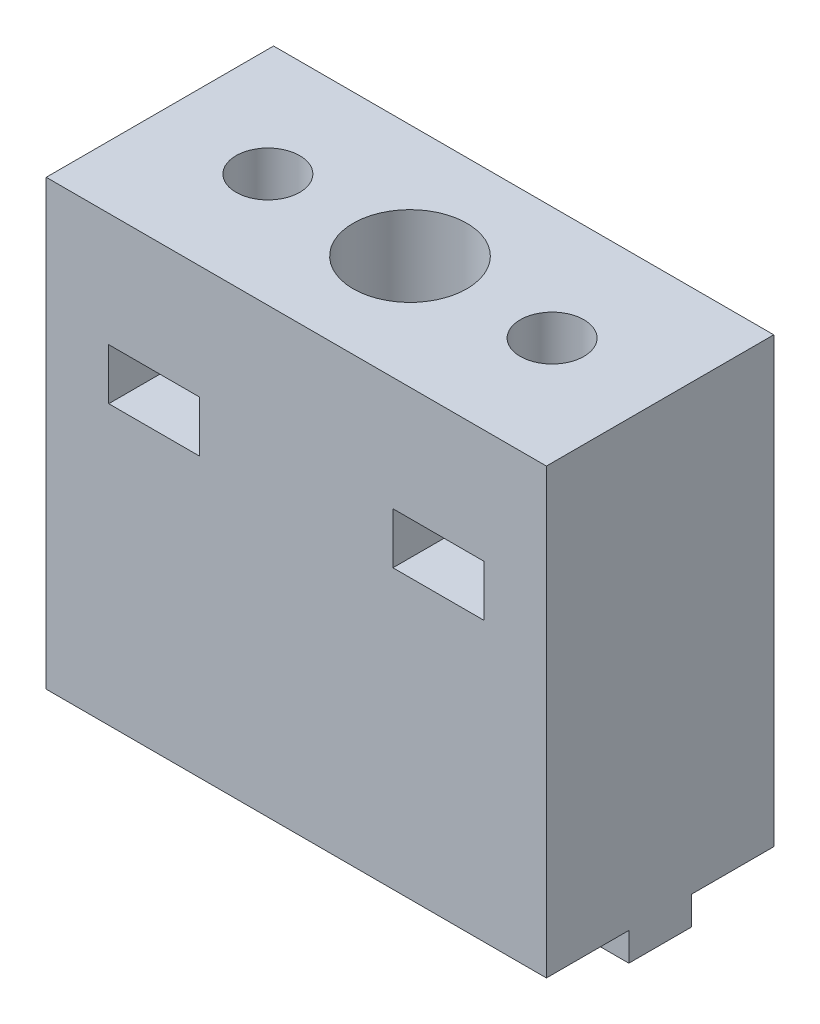
ISO-10303-21;
HEADER;
FILE_DESCRIPTION(('STEP AP214'),'2;1');
FILE_NAME('part.step','',(''),(''),'','','');
FILE_SCHEMA(('AUTOMOTIVE_DESIGN { 1 0 10303 214 1 1 1 1 }'));
ENDSEC;
DATA;
#1=APPLICATION_CONTEXT('core data for automotive mechanical design processes');
#2=APPLICATION_PROTOCOL_DEFINITION('international standard','automotive_design',2000,#1);
#3=PRODUCT_CONTEXT('',#1,'mechanical');
#4=PRODUCT('Part','Part','',(#3));
#5=PRODUCT_RELATED_PRODUCT_CATEGORY('part','',(#4));
#6=PRODUCT_DEFINITION_FORMATION('','',#4);
#7=PRODUCT_DEFINITION_CONTEXT('part definition',#1,'design');
#8=PRODUCT_DEFINITION('design','',#6,#7);
#9=PRODUCT_DEFINITION_SHAPE('','',#8);
#10=(LENGTH_UNIT() NAMED_UNIT(*) SI_UNIT(.MILLI.,.METRE.));
#11=(NAMED_UNIT(*) PLANE_ANGLE_UNIT() SI_UNIT($,.RADIAN.));
#12=(NAMED_UNIT(*) SI_UNIT($,.STERADIAN.) SOLID_ANGLE_UNIT());
#13=UNCERTAINTY_MEASURE_WITH_UNIT(LENGTH_MEASURE(1.E-05),#10,'distance_accuracy_value','');
#14=(GEOMETRIC_REPRESENTATION_CONTEXT(3) GLOBAL_UNCERTAINTY_ASSIGNED_CONTEXT((#13)) GLOBAL_UNIT_ASSIGNED_CONTEXT((#10,
#11,#12)) REPRESENTATION_CONTEXT('',''));
#15=CARTESIAN_POINT('',(0.,0.,0.));
#16=DIRECTION('',(0.,0.,1.));
#17=DIRECTION('',(1.,0.,0.));
#18=AXIS2_PLACEMENT_3D('',#15,#16,#17);
#19=CARTESIAN_POINT('',(21.3032417795605,-2.5,-10.));
#20=DIRECTION('',(0.,1.,0.));
#21=DIRECTION('',(0.,0.,1.));
#22=AXIS2_PLACEMENT_3D('',#19,#20,#21);
#23=CYLINDRICAL_SURFACE('',#22,2.8);
#24=CARTESIAN_POINT('',(21.3032417795605,5.,-10.));
#25=DIRECTION('',(0.,-1.,0.));
#26=DIRECTION('',(0.,0.,-1.));
#27=AXIS2_PLACEMENT_3D('',#24,#25,#26);
#28=CIRCLE('',#27,2.8);
#29=CARTESIAN_POINT('',(21.3032417795605,5.,-12.8));
#30=VERTEX_POINT('',#29);
#31=EDGE_CURVE('E309',#30,#30,#28,.F.);
#32=ORIENTED_EDGE('',*,*,#31,.T.);
#33=EDGE_LOOP('',(#32));
#34=FACE_BOUND('',#33,.T.);
#35=CARTESIAN_POINT('',(21.3032417795605,0.,-10.));
#36=DIRECTION('',(0.,-1.,0.));
#37=DIRECTION('',(0.,0.,-1.));
#38=AXIS2_PLACEMENT_3D('',#35,#36,#37);
#39=CIRCLE('',#38,2.8);
#40=CARTESIAN_POINT('',(21.3032417795605,0.,-12.8));
#41=VERTEX_POINT('',#40);
#42=EDGE_CURVE('E302',#41,#41,#39,.T.);
#43=ORIENTED_EDGE('',*,*,#42,.T.);
#44=EDGE_LOOP('',(#43));
#45=FACE_BOUND('',#44,.T.);
#46=ADVANCED_FACE('F35',(#34,#45),#23,.F.);
#47=CARTESIAN_POINT('',(8.80324177956045,-2.5,-10.));
#48=DIRECTION('',(0.,1.,0.));
#49=DIRECTION('',(0.,0.,1.));
#50=AXIS2_PLACEMENT_3D('',#47,#48,#49);
#51=CYLINDRICAL_SURFACE('',#50,2.8);
#52=CARTESIAN_POINT('',(8.80324177956045,29.,-10.));
#53=DIRECTION('',(0.,1.,0.));
#54=DIRECTION('',(0.,0.,1.));
#55=AXIS2_PLACEMENT_3D('',#52,#53,#54);
#56=CIRCLE('',#55,2.8);
#57=CARTESIAN_POINT('',(8.80324177956045,29.,-7.2));
#58=VERTEX_POINT('',#57);
#59=EDGE_CURVE('E39',#58,#58,#56,.F.);
#60=ORIENTED_EDGE('',*,*,#59,.T.);
#61=EDGE_LOOP('',(#60));
#62=FACE_BOUND('',#61,.T.);
#63=CARTESIAN_POINT('',(8.80324177956045,39.,-10.));
#64=DIRECTION('',(0.,1.,0.));
#65=DIRECTION('',(0.,0.,1.));
#66=AXIS2_PLACEMENT_3D('',#63,#64,#65);
#67=CIRCLE('',#66,2.8);
#68=CARTESIAN_POINT('',(8.80324177956045,39.,-7.2));
#69=VERTEX_POINT('',#68);
#70=EDGE_CURVE('E287',#69,#69,#67,.T.);
#71=ORIENTED_EDGE('',*,*,#70,.T.);
#72=EDGE_LOOP('',(#71));
#73=FACE_BOUND('',#72,.T.);
#74=ADVANCED_FACE('F494',(#62,#73),#51,.F.);
#75=CARTESIAN_POINT('',(33.8032417795605,-2.5,-10.));
#76=DIRECTION('',(0.,1.,0.));
#77=DIRECTION('',(0.,0.,1.));
#78=AXIS2_PLACEMENT_3D('',#75,#76,#77);
#79=CYLINDRICAL_SURFACE('',#78,2.8);
#80=CARTESIAN_POINT('',(33.8032417795605,29.,-10.));
#81=DIRECTION('',(0.,1.,0.));
#82=DIRECTION('',(0.,0.,1.));
#83=AXIS2_PLACEMENT_3D('',#80,#81,#82);
#84=CIRCLE('',#83,2.8);
#85=CARTESIAN_POINT('',(33.8032417795605,29.,-7.2));
#86=VERTEX_POINT('',#85);
#87=EDGE_CURVE('E318',#86,#86,#84,.F.);
#88=ORIENTED_EDGE('',*,*,#87,.T.);
#89=EDGE_LOOP('',(#88));
#90=FACE_BOUND('',#89,.T.);
#91=CARTESIAN_POINT('',(33.8032417795605,39.,-10.));
#92=DIRECTION('',(0.,1.,0.));
#93=DIRECTION('',(0.,0.,1.));
#94=AXIS2_PLACEMENT_3D('',#91,#92,#93);
#95=CIRCLE('',#94,2.8);
#96=CARTESIAN_POINT('',(33.8032417795605,39.,-7.2));
#97=VERTEX_POINT('',#96);
#98=EDGE_CURVE('E306',#97,#97,#95,.T.);
#99=ORIENTED_EDGE('',*,*,#98,.T.);
#100=EDGE_LOOP('',(#99));
#101=FACE_BOUND('',#100,.T.);
#102=ADVANCED_FACE('F521',(#90,#101),#79,.F.);
#103=CARTESIAN_POINT('',(43.3032417795605,-2.5,-12.75));
#104=DIRECTION('',(0.,0.,1.));
#105=DIRECTION('',(1.,0.,0.));
#106=AXIS2_PLACEMENT_3D('',#103,#104,#105);
#107=PLANE('',#106);
#108=DIRECTION('',(1.,0.,0.));
#109=VECTOR('',#108,1.);
#110=CARTESIAN_POINT('',(43.3032417795605,-2.5,-12.75));
#111=LINE('',#110,#109);
#112=CARTESIAN_POINT('',(34.3300244672031,-2.5,-12.75));
#113=VERTEX_POINT('',#112);
#114=CARTESIAN_POINT('',(43.3032417795605,-2.5,-12.75));
#115=VERTEX_POINT('',#114);
#116=EDGE_CURVE('E575',#113,#115,#111,.T.);
#117=ORIENTED_EDGE('',*,*,#116,.F.);
#118=DIRECTION('',(0.,1.,0.));
#119=VECTOR('',#118,1.);
#120=CARTESIAN_POINT('',(34.3300244672031,-2.5,-12.75));
#121=LINE('',#120,#119);
#122=CARTESIAN_POINT('',(34.3300244672031,0.,-12.75));
#123=VERTEX_POINT('',#122);
#124=EDGE_CURVE('E290',#113,#123,#121,.T.);
#125=ORIENTED_EDGE('',*,*,#124,.T.);
#126=DIRECTION('',(1.,0.,0.));
#127=VECTOR('',#126,1.);
#128=CARTESIAN_POINT('',(43.3032417795605,0.,-12.75));
#129=LINE('',#128,#127);
#130=CARTESIAN_POINT('',(43.3032417795605,0.,-12.75));
#131=VERTEX_POINT('',#130);
#132=EDGE_CURVE('E412',#123,#131,#129,.T.);
#133=ORIENTED_EDGE('',*,*,#132,.T.);
#134=DIRECTION('',(0.,1.,0.));
#135=VECTOR('',#134,1.);
#136=CARTESIAN_POINT('',(43.3032417795605,-2.5,-12.75));
#137=LINE('',#136,#135);
#138=EDGE_CURVE('E440',#115,#131,#137,.T.);
#139=ORIENTED_EDGE('',*,*,#138,.F.);
#140=EDGE_LOOP('',(#117,#125,#133,#139));
#141=FACE_BOUND('',#140,.T.);
#142=ADVANCED_FACE('F538',(#141),#107,.F.);
#143=CARTESIAN_POINT('',(26.3032417795604,-2.5,-12.75));
#144=VERTEX_POINT('',#143);
#145=CARTESIAN_POINT('',(33.2764590919178,-2.5,-12.75));
#146=VERTEX_POINT('',#145);
#147=EDGE_CURVE('E576',#144,#146,#111,.T.);
#148=ORIENTED_EDGE('',*,*,#147,.F.);
#149=DIRECTION('',(0.,-1.,0.));
#150=VECTOR('',#149,1.);
#151=CARTESIAN_POINT('',(26.3032417795604,11.4127122105133,-12.75));
#152=LINE('',#151,#150);
#153=CARTESIAN_POINT('',(26.3032417795604,0.,-12.75));
#154=VERTEX_POINT('',#153);
#155=EDGE_CURVE('E228',#154,#144,#152,.T.);
#156=ORIENTED_EDGE('',*,*,#155,.F.);
#157=CARTESIAN_POINT('',(33.2764590919178,0.,-12.75));
#158=VERTEX_POINT('',#157);
#159=EDGE_CURVE('E267',#154,#158,#129,.T.);
#160=ORIENTED_EDGE('',*,*,#159,.T.);
#161=DIRECTION('',(0.,1.,0.));
#162=VECTOR('',#161,1.);
#163=CARTESIAN_POINT('',(33.2764590919178,-2.5,-12.75));
#164=LINE('',#163,#162);
#165=EDGE_CURVE('E295',#158,#146,#164,.F.);
#166=ORIENTED_EDGE('',*,*,#165,.T.);
#167=EDGE_LOOP('',(#148,#156,#160,#166));
#168=FACE_BOUND('',#167,.T.);
#169=ADVANCED_FACE('F585',(#168),#107,.F.);
#170=CARTESIAN_POINT('',(0.,-2.5,0.));
#171=DIRECTION('',(0.,-1.,0.));
#172=DIRECTION('',(0.,0.,-1.));
#173=AXIS2_PLACEMENT_3D('',#170,#171,#172);
#174=PLANE('',#173);
#175=CARTESIAN_POINT('',(33.8032417795605,-2.5,-10.));
#176=DIRECTION('',(0.,1.,0.));
#177=DIRECTION('',(0.,0.,1.));
#178=AXIS2_PLACEMENT_3D('',#175,#176,#177);
#179=CIRCLE('',#178,2.8);
#180=CARTESIAN_POINT('',(34.3300244672031,-2.5,-7.25));
#181=VERTEX_POINT('',#180);
#182=EDGE_CURVE('E305',#181,#113,#179,.T.);
#183=ORIENTED_EDGE('',*,*,#182,.T.);
#184=ORIENTED_EDGE('',*,*,#116,.T.);
#185=DIRECTION('',(0.,0.,1.));
#186=VECTOR('',#185,1.);
#187=CARTESIAN_POINT('',(43.3032417795605,-2.5,-12.75));
#188=LINE('',#187,#186);
#189=CARTESIAN_POINT('',(43.3032417795605,-2.5,-7.25));
#190=VERTEX_POINT('',#189);
#191=EDGE_CURVE('E254',#115,#190,#188,.T.);
#192=ORIENTED_EDGE('',*,*,#191,.T.);
#193=DIRECTION('',(-1.,0.,0.));
#194=VECTOR('',#193,1.);
#195=CARTESIAN_POINT('',(43.3032417795605,-2.5,-7.25));
#196=LINE('',#195,#194);
#197=EDGE_CURVE('E246',#190,#181,#196,.T.);
#198=ORIENTED_EDGE('',*,*,#197,.T.);
#199=EDGE_LOOP('',(#183,#184,#192,#198));
#200=FACE_BOUND('',#199,.T.);
#201=ADVANCED_FACE('F533',(#200),#174,.T.);
#202=DIRECTION('',(0.,0.,1.));
#203=VECTOR('',#202,1.);
#204=CARTESIAN_POINT('',(26.3032417795604,-2.5,-7.25));
#205=LINE('',#204,#203);
#206=CARTESIAN_POINT('',(26.3032417795604,-2.5,-7.25));
#207=VERTEX_POINT('',#206);
#208=EDGE_CURVE('E222',#144,#207,#205,.T.);
#209=ORIENTED_EDGE('',*,*,#208,.F.);
#210=ORIENTED_EDGE('',*,*,#147,.T.);
#211=CARTESIAN_POINT('',(33.2764590919178,-2.5,-7.25));
#212=VERTEX_POINT('',#211);
#213=EDGE_CURVE('E245',#146,#212,#179,.T.);
#214=ORIENTED_EDGE('',*,*,#213,.T.);
#215=EDGE_CURVE('E237',#212,#207,#196,.T.);
#216=ORIENTED_EDGE('',*,*,#215,.T.);
#217=EDGE_LOOP('',(#209,#210,#214,#216));
#218=FACE_BOUND('',#217,.T.);
#219=ADVANCED_FACE('F243',(#218),#174,.T.);
#220=CARTESIAN_POINT('',(43.3032417795605,-2.5,-7.25));
#221=DIRECTION('',(0.,0.,-1.));
#222=DIRECTION('',(-1.,0.,0.));
#223=AXIS2_PLACEMENT_3D('',#220,#221,#222);
#224=PLANE('',#223);
#225=DIRECTION('',(-1.,0.,0.));
#226=VECTOR('',#225,1.);
#227=CARTESIAN_POINT('',(43.3032417795605,0.,-7.25));
#228=LINE('',#227,#226);
#229=CARTESIAN_POINT('',(33.2764590919178,0.,-7.25));
#230=VERTEX_POINT('',#229);
#231=CARTESIAN_POINT('',(26.3032417795604,0.,-7.25));
#232=VERTEX_POINT('',#231);
#233=EDGE_CURVE('E239',#230,#232,#228,.T.);
#234=ORIENTED_EDGE('',*,*,#233,.T.);
#235=DIRECTION('',(0.,-1.,0.));
#236=VECTOR('',#235,1.);
#237=CARTESIAN_POINT('',(26.3032417795604,11.4127122105133,-7.25));
#238=LINE('',#237,#236);
#239=EDGE_CURVE('E225',#232,#207,#238,.T.);
#240=ORIENTED_EDGE('',*,*,#239,.T.);
#241=ORIENTED_EDGE('',*,*,#215,.F.);
#242=DIRECTION('',(0.,1.,0.));
#243=VECTOR('',#242,1.);
#244=CARTESIAN_POINT('',(33.2764590919178,-2.5,-7.25));
#245=LINE('',#244,#243);
#246=EDGE_CURVE('E12',#212,#230,#245,.T.);
#247=ORIENTED_EDGE('',*,*,#246,.T.);
#248=EDGE_LOOP('',(#234,#240,#241,#247));
#249=FACE_BOUND('',#248,.T.);
#250=ADVANCED_FACE('F236',(#249),#224,.F.);
#251=CARTESIAN_POINT('',(16.3032417795605,-2.5,-7.25));
#252=VERTEX_POINT('',#251);
#253=CARTESIAN_POINT('',(9.33002446720312,-2.5,-7.25));
#254=VERTEX_POINT('',#253);
#255=EDGE_CURVE('E247',#252,#254,#196,.T.);
#256=ORIENTED_EDGE('',*,*,#255,.F.);
#257=DIRECTION('',(0.,-1.,0.));
#258=VECTOR('',#257,1.);
#259=CARTESIAN_POINT('',(16.3032417795605,11.4127122105133,-7.25));
#260=LINE('',#259,#258);
#261=CARTESIAN_POINT('',(16.3032417795605,0.,-7.25));
#262=VERTEX_POINT('',#261);
#263=EDGE_CURVE('E240',#262,#252,#260,.T.);
#264=ORIENTED_EDGE('',*,*,#263,.F.);
#265=CARTESIAN_POINT('',(9.33002446720312,0.,-7.25));
#266=VERTEX_POINT('',#265);
#267=EDGE_CURVE('E402',#262,#266,#228,.T.);
#268=ORIENTED_EDGE('',*,*,#267,.T.);
#269=DIRECTION('',(0.,1.,0.));
#270=VECTOR('',#269,1.);
#271=CARTESIAN_POINT('',(9.33002446720312,-2.5,-7.25));
#272=LINE('',#271,#270);
#273=EDGE_CURVE('E275',#266,#254,#272,.F.);
#274=ORIENTED_EDGE('',*,*,#273,.T.);
#275=EDGE_LOOP('',(#256,#264,#268,#274));
#276=FACE_BOUND('',#275,.T.);
#277=ADVANCED_FACE('F401',(#276),#224,.F.);
#278=CARTESIAN_POINT('',(8.27645909191779,-2.5,-7.25));
#279=VERTEX_POINT('',#278);
#280=CARTESIAN_POINT('',(-0.696758220439547,-2.5,-7.25000000000001));
#281=VERTEX_POINT('',#280);
#282=EDGE_CURVE('E249',#279,#281,#196,.T.);
#283=ORIENTED_EDGE('',*,*,#282,.F.);
#284=DIRECTION('',(0.,1.,0.));
#285=VECTOR('',#284,1.);
#286=CARTESIAN_POINT('',(8.27645909191779,-2.5,-7.25));
#287=LINE('',#286,#285);
#288=CARTESIAN_POINT('',(8.27645909191779,0.,-7.25));
#289=VERTEX_POINT('',#288);
#290=EDGE_CURVE('E269',#279,#289,#287,.T.);
#291=ORIENTED_EDGE('',*,*,#290,.T.);
#292=CARTESIAN_POINT('',(-0.696758220439547,0.,-7.25000000000001));
#293=VERTEX_POINT('',#292);
#294=EDGE_CURVE('E272',#289,#293,#228,.T.);
#295=ORIENTED_EDGE('',*,*,#294,.T.);
#296=DIRECTION('',(0.,1.,0.));
#297=VECTOR('',#296,1.);
#298=CARTESIAN_POINT('',(-0.696758220439547,-2.5,-7.25000000000001));
#299=LINE('',#298,#297);
#300=EDGE_CURVE('E439',#281,#293,#299,.T.);
#301=ORIENTED_EDGE('',*,*,#300,.F.);
#302=EDGE_LOOP('',(#283,#291,#295,#301));
#303=FACE_BOUND('',#302,.T.);
#304=ADVANCED_FACE('F541',(#303),#224,.F.);
#305=CARTESIAN_POINT('',(9.33002446720307,0.,-12.75));
#306=VERTEX_POINT('',#305);
#307=CARTESIAN_POINT('',(16.3032417795605,0.,-12.75));
#308=VERTEX_POINT('',#307);
#309=EDGE_CURVE('E265',#306,#308,#129,.T.);
#310=ORIENTED_EDGE('',*,*,#309,.T.);
#311=DIRECTION('',(0.,-1.,0.));
#312=VECTOR('',#311,1.);
#313=CARTESIAN_POINT('',(16.3032417795605,11.4127122105133,-12.75));
#314=LINE('',#313,#312);
#315=CARTESIAN_POINT('',(16.3032417795605,-2.5,-12.75));
#316=VERTEX_POINT('',#315);
#317=EDGE_CURVE('E383',#308,#316,#314,.T.);
#318=ORIENTED_EDGE('',*,*,#317,.T.);
#319=CARTESIAN_POINT('',(9.33002446720307,-2.5,-12.75));
#320=VERTEX_POINT('',#319);
#321=EDGE_CURVE('E577',#320,#316,#111,.T.);
#322=ORIENTED_EDGE('',*,*,#321,.F.);
#323=DIRECTION('',(0.,1.,0.));
#324=VECTOR('',#323,1.);
#325=CARTESIAN_POINT('',(9.33002446720307,-2.5,-12.75));
#326=LINE('',#325,#324);
#327=EDGE_CURVE('E278',#320,#306,#326,.T.);
#328=ORIENTED_EDGE('',*,*,#327,.T.);
#329=EDGE_LOOP('',(#310,#318,#322,#328));
#330=FACE_BOUND('',#329,.T.);
#331=ADVANCED_FACE('F422',(#330),#107,.F.);
#332=DIRECTION('',(0.,0.,-1.));
#333=VECTOR('',#332,1.);
#334=CARTESIAN_POINT('',(16.3032417795605,-2.5,-7.25));
#335=LINE('',#334,#333);
#336=EDGE_CURVE('E232',#252,#316,#335,.T.);
#337=ORIENTED_EDGE('',*,*,#336,.F.);
#338=ORIENTED_EDGE('',*,*,#255,.T.);
#339=CARTESIAN_POINT('',(8.80324177956045,-2.5,-10.));
#340=DIRECTION('',(0.,1.,0.));
#341=DIRECTION('',(0.,0.,1.));
#342=AXIS2_PLACEMENT_3D('',#339,#340,#341);
#343=CIRCLE('',#342,2.8);
#344=EDGE_CURVE('E286',#254,#320,#343,.T.);
#345=ORIENTED_EDGE('',*,*,#344,.T.);
#346=ORIENTED_EDGE('',*,*,#321,.T.);
#347=EDGE_LOOP('',(#337,#338,#345,#346));
#348=FACE_BOUND('',#347,.T.);
#349=ADVANCED_FACE('F534',(#348),#174,.T.);
#350=CARTESIAN_POINT('',(-0.696758220439547,39.,0.));
#351=DIRECTION('',(1.,0.,0.));
#352=DIRECTION('',(0.,0.,-1.));
#353=AXIS2_PLACEMENT_3D('',#350,#351,#352);
#354=PLANE('',#353);
#355=DIRECTION('',(0.,0.,1.));
#356=VECTOR('',#355,1.);
#357=CARTESIAN_POINT('',(-0.696758220439547,0.,0.));
#358=LINE('',#357,#356);
#359=CARTESIAN_POINT('',(-0.696758220439547,0.,-20.));
#360=VERTEX_POINT('',#359);
#361=CARTESIAN_POINT('',(-0.696758220439547,0.,-12.75));
#362=VERTEX_POINT('',#361);
#363=EDGE_CURVE('E460',#360,#362,#358,.T.);
#364=ORIENTED_EDGE('',*,*,#363,.T.);
#365=DIRECTION('',(0.,1.,0.));
#366=VECTOR('',#365,1.);
#367=CARTESIAN_POINT('',(-0.696758220439547,-2.5,-12.75));
#368=LINE('',#367,#366);
#369=CARTESIAN_POINT('',(-0.696758220439547,-2.5,-12.75));
#370=VERTEX_POINT('',#369);
#371=EDGE_CURVE('E435',#370,#362,#368,.T.);
#372=ORIENTED_EDGE('',*,*,#371,.F.);
#373=DIRECTION('',(0.,0.,-1.));
#374=VECTOR('',#373,1.);
#375=CARTESIAN_POINT('',(-0.696758220439547,-2.5,-12.75));
#376=LINE('',#375,#374);
#377=EDGE_CURVE('E251',#281,#370,#376,.T.);
#378=ORIENTED_EDGE('',*,*,#377,.F.);
#379=ORIENTED_EDGE('',*,*,#300,.T.);
#380=CARTESIAN_POINT('',(-0.696758220439547,0.,0.));
#381=VERTEX_POINT('',#380);
#382=EDGE_CURVE('E448',#293,#381,#358,.T.);
#383=ORIENTED_EDGE('',*,*,#382,.T.);
#384=DIRECTION('',(0.,-1.,0.));
#385=VECTOR('',#384,1.);
#386=CARTESIAN_POINT('',(-0.696758220439547,39.,0.));
#387=LINE('',#386,#385);
#388=CARTESIAN_POINT('',(-0.696758220439547,39.,0.));
#389=VERTEX_POINT('',#388);
#390=EDGE_CURVE('E477',#389,#381,#387,.T.);
#391=ORIENTED_EDGE('',*,*,#390,.F.);
#392=DIRECTION('',(0.,0.,1.));
#393=VECTOR('',#392,1.);
#394=CARTESIAN_POINT('',(-0.696758220439547,39.,0.));
#395=LINE('',#394,#393);
#396=CARTESIAN_POINT('',(-0.696758220439547,39.,-20.));
#397=VERTEX_POINT('',#396);
#398=EDGE_CURVE('E449',#397,#389,#395,.T.);
#399=ORIENTED_EDGE('',*,*,#398,.F.);
#400=DIRECTION('',(0.,-1.,0.));
#401=VECTOR('',#400,1.);
#402=CARTESIAN_POINT('',(-0.696758220439547,39.,-20.));
#403=LINE('',#402,#401);
#404=EDGE_CURVE('E459',#397,#360,#403,.T.);
#405=ORIENTED_EDGE('',*,*,#404,.T.);
#406=EDGE_LOOP('',(#364,#372,#378,#379,#383,#391,#399,#405));
#407=FACE_BOUND('',#406,.T.);
#408=ADVANCED_FACE('F37',(#407),#354,.F.);
#409=CARTESIAN_POINT('',(-0.696758220439547,39.,0.));
#410=DIRECTION('',(0.,0.,-1.));
#411=DIRECTION('',(-1.,0.,0.));
#412=AXIS2_PLACEMENT_3D('',#409,#410,#411);
#413=PLANE('',#412);
#414=DIRECTION('',(1.,0.,0.));
#415=VECTOR('',#414,1.);
#416=CARTESIAN_POINT('',(12.8032417795605,29.,0.));
#417=LINE('',#416,#415);
#418=CARTESIAN_POINT('',(4.80324177956045,29.,0.));
#419=VERTEX_POINT('',#418);
#420=CARTESIAN_POINT('',(12.8032417795605,29.,0.));
#421=VERTEX_POINT('',#420);
#422=EDGE_CURVE('E355',#419,#421,#417,.T.);
#423=ORIENTED_EDGE('',*,*,#422,.T.);
#424=DIRECTION('',(0.,-1.,0.));
#425=VECTOR('',#424,1.);
#426=CARTESIAN_POINT('',(12.8032417795605,24.5,0.));
#427=LINE('',#426,#425);
#428=CARTESIAN_POINT('',(12.8032417795605,24.5,0.));
#429=VERTEX_POINT('',#428);
#430=EDGE_CURVE('E365',#421,#429,#427,.T.);
#431=ORIENTED_EDGE('',*,*,#430,.T.);
#432=DIRECTION('',(-1.,0.,0.));
#433=VECTOR('',#432,1.);
#434=CARTESIAN_POINT('',(12.8032417795605,24.5,0.));
#435=LINE('',#434,#433);
#436=CARTESIAN_POINT('',(4.80324177956045,24.5,0.));
#437=VERTEX_POINT('',#436);
#438=EDGE_CURVE('E377',#429,#437,#435,.T.);
#439=ORIENTED_EDGE('',*,*,#438,.T.);
#440=DIRECTION('',(0.,1.,0.));
#441=VECTOR('',#440,1.);
#442=CARTESIAN_POINT('',(4.80324177956045,24.5,0.));
#443=LINE('',#442,#441);
#444=EDGE_CURVE('E52',#437,#419,#443,.T.);
#445=ORIENTED_EDGE('',*,*,#444,.T.);
#446=EDGE_LOOP('',(#423,#431,#439,#445));
#447=FACE_BOUND('',#446,.T.);
#448=DIRECTION('',(1.,0.,0.));
#449=VECTOR('',#448,1.);
#450=CARTESIAN_POINT('',(37.8032417795605,29.,0.));
#451=LINE('',#450,#449);
#452=CARTESIAN_POINT('',(29.8032417795605,29.,0.));
#453=VERTEX_POINT('',#452);
#454=CARTESIAN_POINT('',(37.8032417795605,29.,0.));
#455=VERTEX_POINT('',#454);
#456=EDGE_CURVE('E323',#453,#455,#451,.T.);
#457=ORIENTED_EDGE('',*,*,#456,.T.);
#458=DIRECTION('',(0.,-1.,0.));
#459=VECTOR('',#458,1.);
#460=CARTESIAN_POINT('',(37.8032417795605,24.5,0.));
#461=LINE('',#460,#459);
#462=CARTESIAN_POINT('',(37.8032417795605,24.5,0.));
#463=VERTEX_POINT('',#462);
#464=EDGE_CURVE('E333',#455,#463,#461,.T.);
#465=ORIENTED_EDGE('',*,*,#464,.T.);
#466=DIRECTION('',(-1.,0.,0.));
#467=VECTOR('',#466,1.);
#468=CARTESIAN_POINT('',(37.8032417795605,24.5,0.));
#469=LINE('',#468,#467);
#470=CARTESIAN_POINT('',(29.8032417795605,24.5,0.));
#471=VERTEX_POINT('',#470);
#472=EDGE_CURVE('E347',#463,#471,#469,.T.);
#473=ORIENTED_EDGE('',*,*,#472,.T.);
#474=DIRECTION('',(0.,1.,0.));
#475=VECTOR('',#474,1.);
#476=CARTESIAN_POINT('',(29.8032417795605,24.5,0.));
#477=LINE('',#476,#475);
#478=EDGE_CURVE('E344',#471,#453,#477,.T.);
#479=ORIENTED_EDGE('',*,*,#478,.T.);
#480=EDGE_LOOP('',(#457,#465,#473,#479));
#481=FACE_BOUND('',#480,.T.);
#482=DIRECTION('',(1.,0.,0.));
#483=VECTOR('',#482,1.);
#484=CARTESIAN_POINT('',(-0.696758220439547,0.,0.));
#485=LINE('',#484,#483);
#486=CARTESIAN_POINT('',(43.3032417795605,0.,0.));
#487=VERTEX_POINT('',#486);
#488=EDGE_CURVE('E462',#381,#487,#485,.T.);
#489=ORIENTED_EDGE('',*,*,#488,.T.);
#490=DIRECTION('',(0.,-1.,0.));
#491=VECTOR('',#490,1.);
#492=CARTESIAN_POINT('',(43.3032417795605,39.,0.));
#493=LINE('',#492,#491);
#494=CARTESIAN_POINT('',(43.3032417795605,39.,0.));
#495=VERTEX_POINT('',#494);
#496=EDGE_CURVE('E474',#495,#487,#493,.T.);
#497=ORIENTED_EDGE('',*,*,#496,.F.);
#498=DIRECTION('',(1.,0.,0.));
#499=VECTOR('',#498,1.);
#500=CARTESIAN_POINT('',(-0.696758220439547,39.,0.));
#501=LINE('',#500,#499);
#502=EDGE_CURVE('E452',#389,#495,#501,.T.);
#503=ORIENTED_EDGE('',*,*,#502,.F.);
#504=ORIENTED_EDGE('',*,*,#390,.T.);
#505=EDGE_LOOP('',(#489,#497,#503,#504));
#506=FACE_BOUND('',#505,.T.);
#507=ADVANCED_FACE('F554',(#447,#481,#506),#413,.F.);
#508=CARTESIAN_POINT('',(43.3032417795605,39.,0.));
#509=DIRECTION('',(-1.,0.,0.));
#510=DIRECTION('',(0.,0.,1.));
#511=AXIS2_PLACEMENT_3D('',#508,#509,#510);
#512=PLANE('',#511);
#513=DIRECTION('',(0.,0.,-1.));
#514=VECTOR('',#513,1.);
#515=CARTESIAN_POINT('',(43.3032417795605,0.,0.));
#516=LINE('',#515,#514);
#517=CARTESIAN_POINT('',(43.3032417795605,0.,-7.25));
#518=VERTEX_POINT('',#517);
#519=EDGE_CURVE('E465',#487,#518,#516,.T.);
#520=ORIENTED_EDGE('',*,*,#519,.T.);
#521=DIRECTION('',(0.,1.,0.));
#522=VECTOR('',#521,1.);
#523=CARTESIAN_POINT('',(43.3032417795605,-2.5,-7.25));
#524=LINE('',#523,#522);
#525=EDGE_CURVE('E443',#190,#518,#524,.T.);
#526=ORIENTED_EDGE('',*,*,#525,.F.);
#527=ORIENTED_EDGE('',*,*,#191,.F.);
#528=ORIENTED_EDGE('',*,*,#138,.T.);
#529=CARTESIAN_POINT('',(43.3032417795605,0.,-20.));
#530=VERTEX_POINT('',#529);
#531=EDGE_CURVE('E464',#131,#530,#516,.T.);
#532=ORIENTED_EDGE('',*,*,#531,.T.);
#533=DIRECTION('',(0.,-1.,0.));
#534=VECTOR('',#533,1.);
#535=CARTESIAN_POINT('',(43.3032417795605,39.,-20.));
#536=LINE('',#535,#534);
#537=CARTESIAN_POINT('',(43.3032417795605,39.,-20.));
#538=VERTEX_POINT('',#537);
#539=EDGE_CURVE('E471',#538,#530,#536,.T.);
#540=ORIENTED_EDGE('',*,*,#539,.F.);
#541=DIRECTION('',(0.,0.,-1.));
#542=VECTOR('',#541,1.);
#543=CARTESIAN_POINT('',(43.3032417795605,39.,0.));
#544=LINE('',#543,#542);
#545=EDGE_CURVE('E455',#495,#538,#544,.T.);
#546=ORIENTED_EDGE('',*,*,#545,.F.);
#547=ORIENTED_EDGE('',*,*,#496,.T.);
#548=EDGE_LOOP('',(#520,#526,#527,#528,#532,#540,#546,#547));
#549=FACE_BOUND('',#548,.T.);
#550=ADVANCED_FACE('F551',(#549),#512,.F.);
#551=CARTESIAN_POINT('',(-0.696758220439547,39.,-20.));
#552=DIRECTION('',(0.,0.,1.));
#553=DIRECTION('',(1.,0.,0.));
#554=AXIS2_PLACEMENT_3D('',#551,#552,#553);
#555=PLANE('',#554);
#556=DIRECTION('',(-1.,0.,0.));
#557=VECTOR('',#556,1.);
#558=CARTESIAN_POINT('',(12.8032417795605,24.5,-20.));
#559=LINE('',#558,#557);
#560=CARTESIAN_POINT('',(12.8032417795605,24.5,-20.));
#561=VERTEX_POINT('',#560);
#562=CARTESIAN_POINT('',(4.80324177956045,24.5,-20.));
#563=VERTEX_POINT('',#562);
#564=EDGE_CURVE('E369',#561,#563,#559,.T.);
#565=ORIENTED_EDGE('',*,*,#564,.F.);
#566=DIRECTION('',(0.,-1.,0.));
#567=VECTOR('',#566,1.);
#568=CARTESIAN_POINT('',(12.8032417795605,24.5,-20.));
#569=LINE('',#568,#567);
#570=CARTESIAN_POINT('',(12.8032417795605,29.,-20.));
#571=VERTEX_POINT('',#570);
#572=EDGE_CURVE('E60',#571,#561,#569,.T.);
#573=ORIENTED_EDGE('',*,*,#572,.F.);
#574=DIRECTION('',(1.,0.,0.));
#575=VECTOR('',#574,1.);
#576=CARTESIAN_POINT('',(12.8032417795605,29.,-20.));
#577=LINE('',#576,#575);
#578=CARTESIAN_POINT('',(4.80324177956045,29.,-20.));
#579=VERTEX_POINT('',#578);
#580=EDGE_CURVE('E362',#579,#571,#577,.T.);
#581=ORIENTED_EDGE('',*,*,#580,.F.);
#582=DIRECTION('',(0.,1.,0.));
#583=VECTOR('',#582,1.);
#584=CARTESIAN_POINT('',(4.80324177956045,24.5,-20.));
#585=LINE('',#584,#583);
#586=EDGE_CURVE('E366',#563,#579,#585,.T.);
#587=ORIENTED_EDGE('',*,*,#586,.F.);
#588=EDGE_LOOP('',(#565,#573,#581,#587));
#589=FACE_BOUND('',#588,.T.);
#590=DIRECTION('',(-1.,0.,0.));
#591=VECTOR('',#590,1.);
#592=CARTESIAN_POINT('',(37.8032417795605,24.5,-20.));
#593=LINE('',#592,#591);
#594=CARTESIAN_POINT('',(37.8032417795605,24.5,-20.));
#595=VERTEX_POINT('',#594);
#596=CARTESIAN_POINT('',(29.8032417795605,24.5,-20.));
#597=VERTEX_POINT('',#596);
#598=EDGE_CURVE('E337',#595,#597,#593,.T.);
#599=ORIENTED_EDGE('',*,*,#598,.F.);
#600=DIRECTION('',(0.,-1.,0.));
#601=VECTOR('',#600,1.);
#602=CARTESIAN_POINT('',(37.8032417795605,24.5,-20.));
#603=LINE('',#602,#601);
#604=CARTESIAN_POINT('',(37.8032417795605,29.,-20.));
#605=VERTEX_POINT('',#604);
#606=EDGE_CURVE('E340',#605,#595,#603,.T.);
#607=ORIENTED_EDGE('',*,*,#606,.F.);
#608=DIRECTION('',(1.,0.,0.));
#609=VECTOR('',#608,1.);
#610=CARTESIAN_POINT('',(37.8032417795605,29.,-20.));
#611=LINE('',#610,#609);
#612=CARTESIAN_POINT('',(29.8032417795605,29.,-20.));
#613=VERTEX_POINT('',#612);
#614=EDGE_CURVE('E330',#613,#605,#611,.T.);
#615=ORIENTED_EDGE('',*,*,#614,.F.);
#616=DIRECTION('',(0.,1.,0.));
#617=VECTOR('',#616,1.);
#618=CARTESIAN_POINT('',(29.8032417795605,24.5,-20.));
#619=LINE('',#618,#617);
#620=EDGE_CURVE('E334',#597,#613,#619,.T.);
#621=ORIENTED_EDGE('',*,*,#620,.F.);
#622=EDGE_LOOP('',(#599,#607,#615,#621));
#623=FACE_BOUND('',#622,.T.);
#624=DIRECTION('',(-1.,0.,0.));
#625=VECTOR('',#624,1.);
#626=CARTESIAN_POINT('',(-0.696758220439547,0.,-20.));
#627=LINE('',#626,#625);
#628=EDGE_CURVE('E453',#530,#360,#627,.T.);
#629=ORIENTED_EDGE('',*,*,#628,.T.);
#630=ORIENTED_EDGE('',*,*,#404,.F.);
#631=DIRECTION('',(-1.,0.,0.));
#632=VECTOR('',#631,1.);
#633=CARTESIAN_POINT('',(-0.696758220439547,39.,-20.));
#634=LINE('',#633,#632);
#635=EDGE_CURVE('E457',#538,#397,#634,.T.);
#636=ORIENTED_EDGE('',*,*,#635,.F.);
#637=ORIENTED_EDGE('',*,*,#539,.T.);
#638=EDGE_LOOP('',(#629,#630,#636,#637));
#639=FACE_BOUND('',#638,.T.);
#640=ADVANCED_FACE('F545',(#589,#623,#639),#555,.F.);
#641=CARTESIAN_POINT('',(0.,39.,0.));
#642=DIRECTION('',(0.,-1.,0.));
#643=DIRECTION('',(0.,0.,-1.));
#644=AXIS2_PLACEMENT_3D('',#641,#642,#643);
#645=PLANE('',#644);
#646=CARTESIAN_POINT('',(21.3032417795605,39.,-10.));
#647=DIRECTION('',(0.,1.,0.));
#648=DIRECTION('',(0.,0.,1.));
#649=AXIS2_PLACEMENT_3D('',#646,#647,#648);
#650=CIRCLE('',#649,5.);
#651=CARTESIAN_POINT('',(21.3032417795605,39.,-5.));
#652=VERTEX_POINT('',#651);
#653=EDGE_CURVE('E315',#652,#652,#650,.T.);
#654=ORIENTED_EDGE('',*,*,#653,.F.);
#655=EDGE_LOOP('',(#654));
#656=FACE_BOUND('',#655,.T.);
#657=ORIENTED_EDGE('',*,*,#98,.F.);
#658=EDGE_LOOP('',(#657));
#659=FACE_BOUND('',#658,.T.);
#660=ORIENTED_EDGE('',*,*,#70,.F.);
#661=EDGE_LOOP('',(#660));
#662=FACE_BOUND('',#661,.T.);
#663=ORIENTED_EDGE('',*,*,#398,.T.);
#664=ORIENTED_EDGE('',*,*,#502,.T.);
#665=ORIENTED_EDGE('',*,*,#545,.T.);
#666=ORIENTED_EDGE('',*,*,#635,.T.);
#667=EDGE_LOOP('',(#663,#664,#665,#666));
#668=FACE_BOUND('',#667,.T.);
#669=ADVANCED_FACE('F542',(#656,#659,#662,#668),#645,.F.);
#670=CARTESIAN_POINT('',(0.,0.,0.));
#671=DIRECTION('',(0.,-1.,0.));
#672=DIRECTION('',(0.,0.,-1.));
#673=AXIS2_PLACEMENT_3D('',#670,#671,#672);
#674=PLANE('',#673);
#675=DIRECTION('',(0.,0.,1.));
#676=VECTOR('',#675,1.);
#677=CARTESIAN_POINT('',(16.3032417795605,0.,-7.25));
#678=LINE('',#677,#676);
#679=EDGE_CURVE('E387',#308,#262,#678,.T.);
#680=ORIENTED_EDGE('',*,*,#679,.F.);
#681=ORIENTED_EDGE('',*,*,#309,.F.);
#682=CARTESIAN_POINT('',(8.80324177956045,0.,-10.));
#683=DIRECTION('',(0.,-1.,0.));
#684=DIRECTION('',(0.,0.,-1.));
#685=AXIS2_PLACEMENT_3D('',#682,#683,#684);
#686=CIRCLE('',#685,2.8);
#687=CARTESIAN_POINT('',(8.27645909191783,0.,-12.75));
#688=VERTEX_POINT('',#687);
#689=EDGE_CURVE('E281',#688,#306,#686,.T.);
#690=ORIENTED_EDGE('',*,*,#689,.F.);
#691=EDGE_CURVE('E260',#362,#688,#129,.T.);
#692=ORIENTED_EDGE('',*,*,#691,.F.);
#693=ORIENTED_EDGE('',*,*,#363,.F.);
#694=ORIENTED_EDGE('',*,*,#628,.F.);
#695=ORIENTED_EDGE('',*,*,#531,.F.);
#696=ORIENTED_EDGE('',*,*,#132,.F.);
#697=CARTESIAN_POINT('',(33.8032417795605,0.,-10.));
#698=DIRECTION('',(0.,-1.,0.));
#699=DIRECTION('',(0.,0.,-1.));
#700=AXIS2_PLACEMENT_3D('',#697,#698,#699);
#701=CIRCLE('',#700,2.8);
#702=EDGE_CURVE('E298',#158,#123,#701,.T.);
#703=ORIENTED_EDGE('',*,*,#702,.F.);
#704=ORIENTED_EDGE('',*,*,#159,.F.);
#705=DIRECTION('',(0.,0.,-1.));
#706=VECTOR('',#705,1.);
#707=CARTESIAN_POINT('',(26.3032417795604,0.,-7.25));
#708=LINE('',#707,#706);
#709=EDGE_CURVE('E373',#232,#154,#708,.T.);
#710=ORIENTED_EDGE('',*,*,#709,.F.);
#711=ORIENTED_EDGE('',*,*,#233,.F.);
#712=CARTESIAN_POINT('',(33.8032417795605,0.,-10.));
#713=DIRECTION('',(0.,-1.,0.));
#714=DIRECTION('',(0.,0.,-1.));
#715=AXIS2_PLACEMENT_3D('',#712,#713,#714);
#716=CIRCLE('',#715,2.8);
#717=CARTESIAN_POINT('',(34.3300244672031,0.,-7.25));
#718=VERTEX_POINT('',#717);
#719=EDGE_CURVE('E300',#718,#230,#716,.T.);
#720=ORIENTED_EDGE('',*,*,#719,.F.);
#721=EDGE_CURVE('E409',#518,#718,#228,.T.);
#722=ORIENTED_EDGE('',*,*,#721,.F.);
#723=ORIENTED_EDGE('',*,*,#519,.F.);
#724=ORIENTED_EDGE('',*,*,#488,.F.);
#725=ORIENTED_EDGE('',*,*,#382,.F.);
#726=ORIENTED_EDGE('',*,*,#294,.F.);
#727=CARTESIAN_POINT('',(8.80324177956045,0.,-10.));
#728=DIRECTION('',(0.,-1.,0.));
#729=DIRECTION('',(0.,0.,-1.));
#730=AXIS2_PLACEMENT_3D('',#727,#728,#729);
#731=CIRCLE('',#730,2.8);
#732=EDGE_CURVE('E273',#266,#289,#731,.T.);
#733=ORIENTED_EDGE('',*,*,#732,.F.);
#734=ORIENTED_EDGE('',*,*,#267,.F.);
#735=EDGE_LOOP('',(#680,#681,#690,#692,#693,#694,#695,#696,#703,#704,#710,#711,#720,#722,#723,
#724,#725,#726,#733,#734));
#736=FACE_BOUND('',#735,.T.);
#737=ORIENTED_EDGE('',*,*,#42,.F.);
#738=EDGE_LOOP('',(#737));
#739=FACE_BOUND('',#738,.T.);
#740=ADVANCED_FACE('F405',(#736,#739),#674,.T.);
#741=ORIENTED_EDGE('',*,*,#721,.T.);
#742=DIRECTION('',(0.,1.,0.));
#743=VECTOR('',#742,1.);
#744=CARTESIAN_POINT('',(34.3300244672031,-2.5,-7.25));
#745=LINE('',#744,#743);
#746=EDGE_CURVE('E44',#718,#181,#745,.F.);
#747=ORIENTED_EDGE('',*,*,#746,.T.);
#748=ORIENTED_EDGE('',*,*,#197,.F.);
#749=ORIENTED_EDGE('',*,*,#525,.T.);
#750=EDGE_LOOP('',(#741,#747,#748,#749));
#751=FACE_BOUND('',#750,.T.);
#752=ADVANCED_FACE('F537',(#751),#224,.F.);
#753=ORIENTED_EDGE('',*,*,#691,.T.);
#754=DIRECTION('',(0.,1.,0.));
#755=VECTOR('',#754,1.);
#756=CARTESIAN_POINT('',(8.27645909191783,-2.5,-12.75));
#757=LINE('',#756,#755);
#758=CARTESIAN_POINT('',(8.27645909191784,-2.5,-12.75));
#759=VERTEX_POINT('',#758);
#760=EDGE_CURVE('E283',#688,#759,#757,.F.);
#761=ORIENTED_EDGE('',*,*,#760,.T.);
#762=EDGE_CURVE('E436',#370,#759,#111,.T.);
#763=ORIENTED_EDGE('',*,*,#762,.F.);
#764=ORIENTED_EDGE('',*,*,#371,.T.);
#765=EDGE_LOOP('',(#753,#761,#763,#764));
#766=FACE_BOUND('',#765,.T.);
#767=ADVANCED_FACE('F431',(#766),#107,.F.);
#768=CARTESIAN_POINT('',(8.80324177956045,-2.5,-10.));
#769=DIRECTION('',(0.,-1.,0.));
#770=DIRECTION('',(0.,0.,-1.));
#771=AXIS2_PLACEMENT_3D('',#768,#769,#770);
#772=CIRCLE('',#771,2.8);
#773=EDGE_CURVE('E480',#279,#759,#772,.T.);
#774=ORIENTED_EDGE('',*,*,#773,.F.);
#775=ORIENTED_EDGE('',*,*,#282,.T.);
#776=ORIENTED_EDGE('',*,*,#377,.T.);
#777=ORIENTED_EDGE('',*,*,#762,.T.);
#778=EDGE_LOOP('',(#774,#775,#776,#777));
#779=FACE_BOUND('',#778,.T.);
#780=ADVANCED_FACE('F530',(#779),#174,.T.);
#781=CARTESIAN_POINT('',(8.80324177956045,24.5,-10.));
#782=DIRECTION('',(0.,-1.,0.));
#783=DIRECTION('',(0.,0.,-1.));
#784=AXIS2_PLACEMENT_3D('',#781,#782,#783);
#785=CIRCLE('',#784,2.8);
#786=CARTESIAN_POINT('',(8.80324177956045,24.5,-12.8));
#787=VERTEX_POINT('',#786);
#788=EDGE_CURVE('E361',#787,#787,#785,.F.);
#789=ORIENTED_EDGE('',*,*,#788,.T.);
#790=EDGE_LOOP('',(#789));
#791=FACE_BOUND('',#790,.T.);
#792=ORIENTED_EDGE('',*,*,#773,.T.);
#793=ORIENTED_EDGE('',*,*,#760,.F.);
#794=ORIENTED_EDGE('',*,*,#689,.T.);
#795=ORIENTED_EDGE('',*,*,#327,.F.);
#796=ORIENTED_EDGE('',*,*,#344,.F.);
#797=ORIENTED_EDGE('',*,*,#273,.F.);
#798=ORIENTED_EDGE('',*,*,#732,.T.);
#799=ORIENTED_EDGE('',*,*,#290,.F.);
#800=EDGE_LOOP('',(#792,#793,#794,#795,#796,#797,#798,#799));
#801=FACE_BOUND('',#800,.T.);
#802=ADVANCED_FACE('F523',(#791,#801),#51,.F.);
#803=CARTESIAN_POINT('',(33.8032417795605,24.5,-10.));
#804=DIRECTION('',(0.,-1.,0.));
#805=DIRECTION('',(0.,0.,-1.));
#806=AXIS2_PLACEMENT_3D('',#803,#804,#805);
#807=CIRCLE('',#806,2.8);
#808=CARTESIAN_POINT('',(33.8032417795605,24.5,-12.8));
#809=VERTEX_POINT('',#808);
#810=EDGE_CURVE('E329',#809,#809,#807,.F.);
#811=ORIENTED_EDGE('',*,*,#810,.T.);
#812=EDGE_LOOP('',(#811));
#813=FACE_BOUND('',#812,.T.);
#814=ORIENTED_EDGE('',*,*,#182,.F.);
#815=ORIENTED_EDGE('',*,*,#746,.F.);
#816=ORIENTED_EDGE('',*,*,#719,.T.);
#817=ORIENTED_EDGE('',*,*,#246,.F.);
#818=ORIENTED_EDGE('',*,*,#213,.F.);
#819=ORIENTED_EDGE('',*,*,#165,.F.);
#820=ORIENTED_EDGE('',*,*,#702,.T.);
#821=ORIENTED_EDGE('',*,*,#124,.F.);
#822=EDGE_LOOP('',(#814,#815,#816,#817,#818,#819,#820,#821));
#823=FACE_BOUND('',#822,.T.);
#824=ADVANCED_FACE('F526',(#813,#823),#79,.F.);
#825=CARTESIAN_POINT('',(0.,5.,0.));
#826=DIRECTION('',(0.,-1.,0.));
#827=DIRECTION('',(0.,0.,-1.));
#828=AXIS2_PLACEMENT_3D('',#825,#826,#827);
#829=PLANE('',#828);
#830=CARTESIAN_POINT('',(21.3032417795605,5.,-10.));
#831=DIRECTION('',(0.,-1.,0.));
#832=DIRECTION('',(0.,0.,-1.));
#833=AXIS2_PLACEMENT_3D('',#830,#831,#832);
#834=CIRCLE('',#833,5.);
#835=CARTESIAN_POINT('',(21.3032417795605,5.,-15.));
#836=VERTEX_POINT('',#835);
#837=EDGE_CURVE('E312',#836,#836,#834,.F.);
#838=ORIENTED_EDGE('',*,*,#837,.T.);
#839=EDGE_LOOP('',(#838));
#840=FACE_BOUND('',#839,.T.);
#841=ORIENTED_EDGE('',*,*,#31,.F.);
#842=EDGE_LOOP('',(#841));
#843=FACE_BOUND('',#842,.T.);
#844=ADVANCED_FACE('F615',(#840,#843),#829,.F.);
#845=CARTESIAN_POINT('',(21.3032417795605,-14.142135623731,-10.));
#846=DIRECTION('',(0.,1.,0.));
#847=DIRECTION('',(0.,0.,1.));
#848=AXIS2_PLACEMENT_3D('',#845,#846,#847);
#849=CYLINDRICAL_SURFACE('',#848,5.);
#850=ORIENTED_EDGE('',*,*,#653,.T.);
#851=EDGE_LOOP('',(#850));
#852=FACE_BOUND('',#851,.T.);
#853=ORIENTED_EDGE('',*,*,#837,.F.);
#854=EDGE_LOOP('',(#853));
#855=FACE_BOUND('',#854,.T.);
#856=ADVANCED_FACE('F620',(#852,#855),#849,.F.);
#857=CARTESIAN_POINT('',(37.8032417795605,29.,0.));
#858=DIRECTION('',(0.,1.,0.));
#859=DIRECTION('',(0.,0.,1.));
#860=AXIS2_PLACEMENT_3D('',#857,#858,#859);
#861=PLANE('',#860);
#862=ORIENTED_EDGE('',*,*,#614,.T.);
#863=DIRECTION('',(0.,0.,-1.));
#864=VECTOR('',#863,1.);
#865=CARTESIAN_POINT('',(37.8032417795605,29.,0.));
#866=LINE('',#865,#864);
#867=EDGE_CURVE('E327',#455,#605,#866,.T.);
#868=ORIENTED_EDGE('',*,*,#867,.F.);
#869=ORIENTED_EDGE('',*,*,#456,.F.);
#870=DIRECTION('',(0.,0.,-1.));
#871=VECTOR('',#870,1.);
#872=CARTESIAN_POINT('',(29.8032417795605,29.,0.));
#873=LINE('',#872,#871);
#874=EDGE_CURVE('E325',#453,#613,#873,.T.);
#875=ORIENTED_EDGE('',*,*,#874,.T.);
#876=EDGE_LOOP('',(#862,#868,#869,#875));
#877=FACE_BOUND('',#876,.T.);
#878=ORIENTED_EDGE('',*,*,#87,.F.);
#879=EDGE_LOOP('',(#878));
#880=FACE_BOUND('',#879,.T.);
#881=ADVANCED_FACE('F626',(#877,#880),#861,.F.);
#882=CARTESIAN_POINT('',(37.8032417795605,24.5,0.));
#883=DIRECTION('',(0.,-1.,0.));
#884=DIRECTION('',(0.,0.,-1.));
#885=AXIS2_PLACEMENT_3D('',#882,#883,#884);
#886=PLANE('',#885);
#887=ORIENTED_EDGE('',*,*,#598,.T.);
#888=DIRECTION('',(0.,0.,-1.));
#889=VECTOR('',#888,1.);
#890=CARTESIAN_POINT('',(29.8032417795605,24.5,0.));
#891=LINE('',#890,#889);
#892=EDGE_CURVE('E322',#471,#597,#891,.T.);
#893=ORIENTED_EDGE('',*,*,#892,.F.);
#894=ORIENTED_EDGE('',*,*,#472,.F.);
#895=DIRECTION('',(0.,0.,-1.));
#896=VECTOR('',#895,1.);
#897=CARTESIAN_POINT('',(37.8032417795605,24.5,0.));
#898=LINE('',#897,#896);
#899=EDGE_CURVE('E319',#463,#595,#898,.T.);
#900=ORIENTED_EDGE('',*,*,#899,.T.);
#901=EDGE_LOOP('',(#887,#893,#894,#900));
#902=FACE_BOUND('',#901,.T.);
#903=ORIENTED_EDGE('',*,*,#810,.F.);
#904=EDGE_LOOP('',(#903));
#905=FACE_BOUND('',#904,.T.);
#906=ADVANCED_FACE('F624',(#902,#905),#886,.F.);
#907=CARTESIAN_POINT('',(37.8032417795605,24.5,0.));
#908=DIRECTION('',(1.,0.,0.));
#909=DIRECTION('',(0.,0.,-1.));
#910=AXIS2_PLACEMENT_3D('',#907,#908,#909);
#911=PLANE('',#910);
#912=ORIENTED_EDGE('',*,*,#606,.T.);
#913=ORIENTED_EDGE('',*,*,#899,.F.);
#914=ORIENTED_EDGE('',*,*,#464,.F.);
#915=ORIENTED_EDGE('',*,*,#867,.T.);
#916=EDGE_LOOP('',(#912,#913,#914,#915));
#917=FACE_BOUND('',#916,.T.);
#918=ADVANCED_FACE('F510',(#917),#911,.F.);
#919=CARTESIAN_POINT('',(29.8032417795605,24.5,0.));
#920=DIRECTION('',(-1.,0.,0.));
#921=DIRECTION('',(0.,0.,1.));
#922=AXIS2_PLACEMENT_3D('',#919,#920,#921);
#923=PLANE('',#922);
#924=ORIENTED_EDGE('',*,*,#620,.T.);
#925=ORIENTED_EDGE('',*,*,#874,.F.);
#926=ORIENTED_EDGE('',*,*,#478,.F.);
#927=ORIENTED_EDGE('',*,*,#892,.T.);
#928=EDGE_LOOP('',(#924,#925,#926,#927));
#929=FACE_BOUND('',#928,.T.);
#930=ADVANCED_FACE('F500',(#929),#923,.F.);
#931=CARTESIAN_POINT('',(12.8032417795605,29.,0.));
#932=DIRECTION('',(0.,1.,0.));
#933=DIRECTION('',(0.,0.,1.));
#934=AXIS2_PLACEMENT_3D('',#931,#932,#933);
#935=PLANE('',#934);
#936=ORIENTED_EDGE('',*,*,#580,.T.);
#937=DIRECTION('',(0.,0.,-1.));
#938=VECTOR('',#937,1.);
#939=CARTESIAN_POINT('',(12.8032417795605,29.,0.));
#940=LINE('',#939,#938);
#941=EDGE_CURVE('E359',#421,#571,#940,.T.);
#942=ORIENTED_EDGE('',*,*,#941,.F.);
#943=ORIENTED_EDGE('',*,*,#422,.F.);
#944=DIRECTION('',(0.,0.,-1.));
#945=VECTOR('',#944,1.);
#946=CARTESIAN_POINT('',(4.80324177956045,29.,0.));
#947=LINE('',#946,#945);
#948=EDGE_CURVE('E357',#419,#579,#947,.T.);
#949=ORIENTED_EDGE('',*,*,#948,.T.);
#950=EDGE_LOOP('',(#936,#942,#943,#949));
#951=FACE_BOUND('',#950,.T.);
#952=ORIENTED_EDGE('',*,*,#59,.F.);
#953=EDGE_LOOP('',(#952));
#954=FACE_BOUND('',#953,.T.);
#955=ADVANCED_FACE('F497',(#951,#954),#935,.F.);
#956=CARTESIAN_POINT('',(12.8032417795605,24.5,0.));
#957=DIRECTION('',(0.,-1.,0.));
#958=DIRECTION('',(0.,0.,-1.));
#959=AXIS2_PLACEMENT_3D('',#956,#957,#958);
#960=PLANE('',#959);
#961=ORIENTED_EDGE('',*,*,#564,.T.);
#962=DIRECTION('',(0.,0.,-1.));
#963=VECTOR('',#962,1.);
#964=CARTESIAN_POINT('',(4.80324177956045,24.5,0.));
#965=LINE('',#964,#963);
#966=EDGE_CURVE('E354',#437,#563,#965,.T.);
#967=ORIENTED_EDGE('',*,*,#966,.F.);
#968=ORIENTED_EDGE('',*,*,#438,.F.);
#969=DIRECTION('',(0.,0.,-1.));
#970=VECTOR('',#969,1.);
#971=CARTESIAN_POINT('',(12.8032417795605,24.5,0.));
#972=LINE('',#971,#970);
#973=EDGE_CURVE('E352',#429,#561,#972,.T.);
#974=ORIENTED_EDGE('',*,*,#973,.T.);
#975=EDGE_LOOP('',(#961,#967,#968,#974));
#976=FACE_BOUND('',#975,.T.);
#977=ORIENTED_EDGE('',*,*,#788,.F.);
#978=EDGE_LOOP('',(#977));
#979=FACE_BOUND('',#978,.T.);
#980=ADVANCED_FACE('F499',(#976,#979),#960,.F.);
#981=CARTESIAN_POINT('',(12.8032417795605,24.5,0.));
#982=DIRECTION('',(1.,0.,0.));
#983=DIRECTION('',(0.,0.,-1.));
#984=AXIS2_PLACEMENT_3D('',#981,#982,#983);
#985=PLANE('',#984);
#986=ORIENTED_EDGE('',*,*,#572,.T.);
#987=ORIENTED_EDGE('',*,*,#973,.F.);
#988=ORIENTED_EDGE('',*,*,#430,.F.);
#989=ORIENTED_EDGE('',*,*,#941,.T.);
#990=EDGE_LOOP('',(#986,#987,#988,#989));
#991=FACE_BOUND('',#990,.T.);
#992=ADVANCED_FACE('F507',(#991),#985,.F.);
#993=CARTESIAN_POINT('',(4.80324177956045,24.5,0.));
#994=DIRECTION('',(-1.,0.,0.));
#995=DIRECTION('',(0.,0.,1.));
#996=AXIS2_PLACEMENT_3D('',#993,#994,#995);
#997=PLANE('',#996);
#998=ORIENTED_EDGE('',*,*,#586,.T.);
#999=ORIENTED_EDGE('',*,*,#948,.F.);
#1000=ORIENTED_EDGE('',*,*,#444,.F.);
#1001=ORIENTED_EDGE('',*,*,#966,.T.);
#1002=EDGE_LOOP('',(#998,#999,#1000,#1001));
#1003=FACE_BOUND('',#1002,.T.);
#1004=ADVANCED_FACE('F697',(#1003),#997,.F.);
#1005=CARTESIAN_POINT('',(26.3032417795604,11.4127122105133,-7.25));
#1006=DIRECTION('',(1.,0.,0.));
#1007=DIRECTION('',(0.,0.,-1.));
#1008=AXIS2_PLACEMENT_3D('',#1005,#1006,#1007);
#1009=PLANE('',#1008);
#1010=ORIENTED_EDGE('',*,*,#709,.T.);
#1011=ORIENTED_EDGE('',*,*,#155,.T.);
#1012=ORIENTED_EDGE('',*,*,#208,.T.);
#1013=ORIENTED_EDGE('',*,*,#239,.F.);
#1014=EDGE_LOOP('',(#1010,#1011,#1012,#1013));
#1015=FACE_BOUND('',#1014,.T.);
#1016=ADVANCED_FACE('F224',(#1015),#1009,.F.);
#1017=CARTESIAN_POINT('',(16.3032417795605,11.4127122105133,-7.25));
#1018=DIRECTION('',(-1.,0.,0.));
#1019=DIRECTION('',(0.,0.,1.));
#1020=AXIS2_PLACEMENT_3D('',#1017,#1018,#1019);
#1021=PLANE('',#1020);
#1022=ORIENTED_EDGE('',*,*,#679,.T.);
#1023=ORIENTED_EDGE('',*,*,#263,.T.);
#1024=ORIENTED_EDGE('',*,*,#336,.T.);
#1025=ORIENTED_EDGE('',*,*,#317,.F.);
#1026=EDGE_LOOP('',(#1022,#1023,#1024,#1025));
#1027=FACE_BOUND('',#1026,.T.);
#1028=ADVANCED_FACE('F393',(#1027),#1021,.F.);
#1029=CLOSED_SHELL('',(#46,#74,#102,#142,#169,#201,#219,#250,#277,#304,#331,#349,#408,#507,#550,
#640,#669,#740,#752,#767,#780,#802,#824,#844,#856,#881,#906,#918,#930,#955,#980,#992,#1004,
#1016,#1028));
#1030=MANIFOLD_SOLID_BREP('B2',#1029);
#1031=ADVANCED_BREP_SHAPE_REPRESENTATION('',(#18,#1030),#14);
#1032=SHAPE_DEFINITION_REPRESENTATION(#9,#1031);
ENDSEC;
END-ISO-10303-21;
